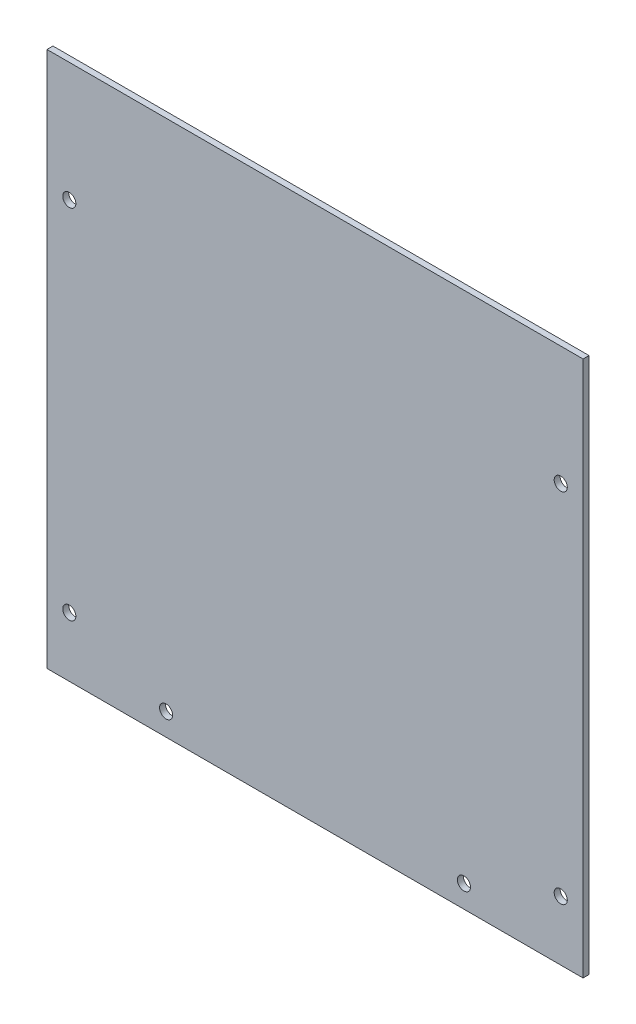
ISO-10303-21;
HEADER;
FILE_DESCRIPTION(('STEP AP214'),'2;1');
FILE_NAME('part.step','',(''),(''),'','','');
FILE_SCHEMA(('AUTOMOTIVE_DESIGN { 1 0 10303 214 1 1 1 1 }'));
ENDSEC;
DATA;
#1=APPLICATION_CONTEXT('core data for automotive mechanical design processes');
#2=APPLICATION_PROTOCOL_DEFINITION('international standard','automotive_design',2000,#1);
#3=PRODUCT_CONTEXT('',#1,'mechanical');
#4=PRODUCT('Part','Part','',(#3));
#5=PRODUCT_RELATED_PRODUCT_CATEGORY('part','',(#4));
#6=PRODUCT_DEFINITION_FORMATION('','',#4);
#7=PRODUCT_DEFINITION_CONTEXT('part definition',#1,'design');
#8=PRODUCT_DEFINITION('design','',#6,#7);
#9=PRODUCT_DEFINITION_SHAPE('','',#8);
#10=(LENGTH_UNIT() NAMED_UNIT(*) SI_UNIT(.MILLI.,.METRE.));
#11=(NAMED_UNIT(*) PLANE_ANGLE_UNIT() SI_UNIT($,.RADIAN.));
#12=(NAMED_UNIT(*) SI_UNIT($,.STERADIAN.) SOLID_ANGLE_UNIT());
#13=UNCERTAINTY_MEASURE_WITH_UNIT(LENGTH_MEASURE(1.E-05),#10,'distance_accuracy_value','');
#14=(GEOMETRIC_REPRESENTATION_CONTEXT(3) GLOBAL_UNCERTAINTY_ASSIGNED_CONTEXT((#13)) GLOBAL_UNIT_ASSIGNED_CONTEXT((#10,
#11,#12)) REPRESENTATION_CONTEXT('',''));
#15=CARTESIAN_POINT('',(0.,0.,0.));
#16=DIRECTION('',(0.,0.,1.));
#17=DIRECTION('',(1.,0.,0.));
#18=AXIS2_PLACEMENT_3D('',#15,#16,#17);
#19=CARTESIAN_POINT('',(90.,90.,2.));
#20=DIRECTION('',(-1.,0.,0.));
#21=DIRECTION('',(0.,-1.,0.));
#22=AXIS2_PLACEMENT_3D('',#19,#20,#21);
#23=PLANE('',#22);
#24=DIRECTION('',(0.,1.,0.));
#25=VECTOR('',#24,1.);
#26=CARTESIAN_POINT('',(90.,90.,0.));
#27=LINE('',#26,#25);
#28=CARTESIAN_POINT('',(90.,-90.,0.));
#29=VERTEX_POINT('',#28);
#30=CARTESIAN_POINT('',(90.,90.,0.));
#31=VERTEX_POINT('',#30);
#32=EDGE_CURVE('E99',#29,#31,#27,.T.);
#33=ORIENTED_EDGE('',*,*,#32,.T.);
#34=DIRECTION('',(0.,0.,-1.));
#35=VECTOR('',#34,1.);
#36=CARTESIAN_POINT('',(90.,90.,2.));
#37=LINE('',#36,#35);
#38=CARTESIAN_POINT('',(90.,90.,2.));
#39=VERTEX_POINT('',#38);
#40=EDGE_CURVE('E11',#39,#31,#37,.T.);
#41=ORIENTED_EDGE('',*,*,#40,.F.);
#42=DIRECTION('',(0.,1.,0.));
#43=VECTOR('',#42,1.);
#44=CARTESIAN_POINT('',(90.,90.,2.));
#45=LINE('',#44,#43);
#46=CARTESIAN_POINT('',(90.,-90.,2.));
#47=VERTEX_POINT('',#46);
#48=EDGE_CURVE('E86',#47,#39,#45,.T.);
#49=ORIENTED_EDGE('',*,*,#48,.F.);
#50=DIRECTION('',(0.,0.,-1.));
#51=VECTOR('',#50,1.);
#52=CARTESIAN_POINT('',(90.,-90.,2.));
#53=LINE('',#52,#51);
#54=EDGE_CURVE('E95',#47,#29,#53,.T.);
#55=ORIENTED_EDGE('',*,*,#54,.T.);
#56=EDGE_LOOP('',(#33,#41,#49,#55));
#57=FACE_BOUND('',#56,.T.);
#58=ADVANCED_FACE('F33',(#57),#23,.F.);
#59=CARTESIAN_POINT('',(-90.,90.,2.));
#60=DIRECTION('',(0.,-1.,0.));
#61=DIRECTION('',(0.,0.,-1.));
#62=AXIS2_PLACEMENT_3D('',#59,#60,#61);
#63=PLANE('',#62);
#64=DIRECTION('',(-1.,0.,0.));
#65=VECTOR('',#64,1.);
#66=CARTESIAN_POINT('',(-90.,90.,0.));
#67=LINE('',#66,#65);
#68=CARTESIAN_POINT('',(-90.,90.,0.));
#69=VERTEX_POINT('',#68);
#70=EDGE_CURVE('E90',#31,#69,#67,.T.);
#71=ORIENTED_EDGE('',*,*,#70,.T.);
#72=DIRECTION('',(0.,0.,-1.));
#73=VECTOR('',#72,1.);
#74=CARTESIAN_POINT('',(-90.,90.,2.));
#75=LINE('',#74,#73);
#76=CARTESIAN_POINT('',(-90.,90.,2.));
#77=VERTEX_POINT('',#76);
#78=EDGE_CURVE('E42',#77,#69,#75,.T.);
#79=ORIENTED_EDGE('',*,*,#78,.F.);
#80=DIRECTION('',(-1.,0.,0.));
#81=VECTOR('',#80,1.);
#82=CARTESIAN_POINT('',(-90.,90.,2.));
#83=LINE('',#82,#81);
#84=EDGE_CURVE('E81',#39,#77,#83,.T.);
#85=ORIENTED_EDGE('',*,*,#84,.F.);
#86=ORIENTED_EDGE('',*,*,#40,.T.);
#87=EDGE_LOOP('',(#71,#79,#85,#86));
#88=FACE_BOUND('',#87,.T.);
#89=ADVANCED_FACE('F89',(#88),#63,.F.);
#90=CARTESIAN_POINT('',(-90.,90.,2.));
#91=DIRECTION('',(1.,0.,0.));
#92=DIRECTION('',(0.,1.,0.));
#93=AXIS2_PLACEMENT_3D('',#90,#91,#92);
#94=PLANE('',#93);
#95=DIRECTION('',(0.,-1.,0.));
#96=VECTOR('',#95,1.);
#97=CARTESIAN_POINT('',(-90.,90.,0.));
#98=LINE('',#97,#96);
#99=CARTESIAN_POINT('',(-90.,-90.,0.));
#100=VERTEX_POINT('',#99);
#101=EDGE_CURVE('E68',#69,#100,#98,.T.);
#102=ORIENTED_EDGE('',*,*,#101,.T.);
#103=DIRECTION('',(0.,0.,-1.));
#104=VECTOR('',#103,1.);
#105=CARTESIAN_POINT('',(-90.,-90.,2.));
#106=LINE('',#105,#104);
#107=CARTESIAN_POINT('',(-90.,-90.,2.));
#108=VERTEX_POINT('',#107);
#109=EDGE_CURVE('E91',#108,#100,#106,.T.);
#110=ORIENTED_EDGE('',*,*,#109,.F.);
#111=DIRECTION('',(0.,-1.,0.));
#112=VECTOR('',#111,1.);
#113=CARTESIAN_POINT('',(-90.,90.,2.));
#114=LINE('',#113,#112);
#115=EDGE_CURVE('E84',#77,#108,#114,.T.);
#116=ORIENTED_EDGE('',*,*,#115,.F.);
#117=ORIENTED_EDGE('',*,*,#78,.T.);
#118=EDGE_LOOP('',(#102,#110,#116,#117));
#119=FACE_BOUND('',#118,.T.);
#120=ADVANCED_FACE('F93',(#119),#94,.F.);
#121=CARTESIAN_POINT('',(-90.,-90.,2.));
#122=DIRECTION('',(0.,1.,0.));
#123=DIRECTION('',(0.,0.,1.));
#124=AXIS2_PLACEMENT_3D('',#121,#122,#123);
#125=PLANE('',#124);
#126=DIRECTION('',(1.,0.,0.));
#127=VECTOR('',#126,1.);
#128=CARTESIAN_POINT('',(-90.,-90.,0.));
#129=LINE('',#128,#127);
#130=EDGE_CURVE('E74',#100,#29,#129,.T.);
#131=ORIENTED_EDGE('',*,*,#130,.T.);
#132=ORIENTED_EDGE('',*,*,#54,.F.);
#133=DIRECTION('',(1.,0.,0.));
#134=VECTOR('',#133,1.);
#135=CARTESIAN_POINT('',(-90.,-90.,2.));
#136=LINE('',#135,#134);
#137=EDGE_CURVE('E51',#108,#47,#136,.T.);
#138=ORIENTED_EDGE('',*,*,#137,.F.);
#139=ORIENTED_EDGE('',*,*,#109,.T.);
#140=EDGE_LOOP('',(#131,#132,#138,#139));
#141=FACE_BOUND('',#140,.T.);
#142=ADVANCED_FACE('F153',(#141),#125,.F.);
#143=CARTESIAN_POINT('',(0.,0.,2.));
#144=DIRECTION('',(0.,0.,1.));
#145=DIRECTION('',(1.,0.,0.));
#146=AXIS2_PLACEMENT_3D('',#143,#144,#145);
#147=PLANE('',#146);
#148=CARTESIAN_POINT('',(82.5,50.,2.));
#149=DIRECTION('',(0.,0.,1.));
#150=DIRECTION('',(1.,0.,0.));
#151=AXIS2_PLACEMENT_3D('',#148,#149,#150);
#152=CIRCLE('',#151,2.20000000000001);
#153=CARTESIAN_POINT('',(84.7,50.,2.));
#154=VERTEX_POINT('',#153);
#155=EDGE_CURVE('E138',#154,#154,#152,.T.);
#156=ORIENTED_EDGE('',*,*,#155,.F.);
#157=EDGE_LOOP('',(#156));
#158=FACE_BOUND('',#157,.T.);
#159=CARTESIAN_POINT('',(82.5,-70.,2.));
#160=DIRECTION('',(0.,0.,1.));
#161=DIRECTION('',(1.,0.,0.));
#162=AXIS2_PLACEMENT_3D('',#159,#160,#161);
#163=CIRCLE('',#162,2.20000000000001);
#164=CARTESIAN_POINT('',(84.7,-70.,2.));
#165=VERTEX_POINT('',#164);
#166=EDGE_CURVE('E141',#165,#165,#163,.T.);
#167=ORIENTED_EDGE('',*,*,#166,.F.);
#168=EDGE_LOOP('',(#167));
#169=FACE_BOUND('',#168,.T.);
#170=CARTESIAN_POINT('',(-82.5,-70.,2.));
#171=DIRECTION('',(0.,0.,1.));
#172=DIRECTION('',(1.,0.,0.));
#173=AXIS2_PLACEMENT_3D('',#170,#171,#172);
#174=CIRCLE('',#173,2.20000000000001);
#175=CARTESIAN_POINT('',(-80.3,-70.,2.));
#176=VERTEX_POINT('',#175);
#177=EDGE_CURVE('E137',#176,#176,#174,.T.);
#178=ORIENTED_EDGE('',*,*,#177,.F.);
#179=EDGE_LOOP('',(#178));
#180=FACE_BOUND('',#179,.T.);
#181=CARTESIAN_POINT('',(-82.5,50.,2.));
#182=DIRECTION('',(0.,0.,1.));
#183=DIRECTION('',(1.,0.,0.));
#184=AXIS2_PLACEMENT_3D('',#181,#182,#183);
#185=CIRCLE('',#184,2.20000000000001);
#186=CARTESIAN_POINT('',(-80.3,50.,2.));
#187=VERTEX_POINT('',#186);
#188=EDGE_CURVE('E118',#187,#187,#185,.T.);
#189=ORIENTED_EDGE('',*,*,#188,.F.);
#190=EDGE_LOOP('',(#189));
#191=FACE_BOUND('',#190,.T.);
#192=CARTESIAN_POINT('',(-50.,-82.5,2.));
#193=DIRECTION('',(0.,0.,1.));
#194=DIRECTION('',(1.,0.,0.));
#195=AXIS2_PLACEMENT_3D('',#192,#193,#194);
#196=CIRCLE('',#195,2.2);
#197=CARTESIAN_POINT('',(-47.8,-82.5,2.));
#198=VERTEX_POINT('',#197);
#199=EDGE_CURVE('E111',#198,#198,#196,.T.);
#200=ORIENTED_EDGE('',*,*,#199,.F.);
#201=EDGE_LOOP('',(#200));
#202=FACE_BOUND('',#201,.T.);
#203=CARTESIAN_POINT('',(50.,-82.5,2.));
#204=DIRECTION('',(0.,0.,1.));
#205=DIRECTION('',(1.,0.,0.));
#206=AXIS2_PLACEMENT_3D('',#203,#204,#205);
#207=CIRCLE('',#206,2.2);
#208=CARTESIAN_POINT('',(52.2,-82.5,2.));
#209=VERTEX_POINT('',#208);
#210=EDGE_CURVE('E125',#209,#209,#207,.T.);
#211=ORIENTED_EDGE('',*,*,#210,.F.);
#212=EDGE_LOOP('',(#211));
#213=FACE_BOUND('',#212,.T.);
#214=ORIENTED_EDGE('',*,*,#48,.T.);
#215=ORIENTED_EDGE('',*,*,#84,.T.);
#216=ORIENTED_EDGE('',*,*,#115,.T.);
#217=ORIENTED_EDGE('',*,*,#137,.T.);
#218=EDGE_LOOP('',(#214,#215,#216,#217));
#219=FACE_BOUND('',#218,.T.);
#220=ADVANCED_FACE('F82',(#158,#169,#180,#191,#202,#213,#219),#147,.T.);
#221=CARTESIAN_POINT('',(0.,0.,0.));
#222=DIRECTION('',(0.,0.,1.));
#223=DIRECTION('',(1.,0.,0.));
#224=AXIS2_PLACEMENT_3D('',#221,#222,#223);
#225=PLANE('',#224);
#226=CARTESIAN_POINT('',(82.5,50.,0.));
#227=DIRECTION('',(0.,0.,1.));
#228=DIRECTION('',(1.,0.,0.));
#229=AXIS2_PLACEMENT_3D('',#226,#227,#228);
#230=CIRCLE('',#229,2.20000000000001);
#231=CARTESIAN_POINT('',(84.7,50.,0.));
#232=VERTEX_POINT('',#231);
#233=EDGE_CURVE('E36',#232,#232,#230,.T.);
#234=ORIENTED_EDGE('',*,*,#233,.T.);
#235=EDGE_LOOP('',(#234));
#236=FACE_BOUND('',#235,.T.);
#237=CARTESIAN_POINT('',(82.5,-70.,0.));
#238=DIRECTION('',(0.,0.,1.));
#239=DIRECTION('',(1.,0.,0.));
#240=AXIS2_PLACEMENT_3D('',#237,#238,#239);
#241=CIRCLE('',#240,2.20000000000001);
#242=CARTESIAN_POINT('',(84.7,-70.,0.));
#243=VERTEX_POINT('',#242);
#244=EDGE_CURVE('E120',#243,#243,#241,.T.);
#245=ORIENTED_EDGE('',*,*,#244,.T.);
#246=EDGE_LOOP('',(#245));
#247=FACE_BOUND('',#246,.T.);
#248=CARTESIAN_POINT('',(-82.5,-70.,0.));
#249=DIRECTION('',(0.,0.,1.));
#250=DIRECTION('',(1.,0.,0.));
#251=AXIS2_PLACEMENT_3D('',#248,#249,#250);
#252=CIRCLE('',#251,2.20000000000001);
#253=CARTESIAN_POINT('',(-80.3,-70.,0.));
#254=VERTEX_POINT('',#253);
#255=EDGE_CURVE('E117',#254,#254,#252,.T.);
#256=ORIENTED_EDGE('',*,*,#255,.T.);
#257=EDGE_LOOP('',(#256));
#258=FACE_BOUND('',#257,.T.);
#259=CARTESIAN_POINT('',(-82.5,50.,0.));
#260=DIRECTION('',(0.,0.,1.));
#261=DIRECTION('',(1.,0.,0.));
#262=AXIS2_PLACEMENT_3D('',#259,#260,#261);
#263=CIRCLE('',#262,2.20000000000001);
#264=CARTESIAN_POINT('',(-80.3,50.,0.));
#265=VERTEX_POINT('',#264);
#266=EDGE_CURVE('E114',#265,#265,#263,.T.);
#267=ORIENTED_EDGE('',*,*,#266,.T.);
#268=EDGE_LOOP('',(#267));
#269=FACE_BOUND('',#268,.T.);
#270=CARTESIAN_POINT('',(-50.,-82.5,0.));
#271=DIRECTION('',(0.,0.,1.));
#272=DIRECTION('',(1.,0.,0.));
#273=AXIS2_PLACEMENT_3D('',#270,#271,#272);
#274=CIRCLE('',#273,2.2);
#275=CARTESIAN_POINT('',(-47.8,-82.5,0.));
#276=VERTEX_POINT('',#275);
#277=EDGE_CURVE('E102',#276,#276,#274,.T.);
#278=ORIENTED_EDGE('',*,*,#277,.T.);
#279=EDGE_LOOP('',(#278));
#280=FACE_BOUND('',#279,.T.);
#281=CARTESIAN_POINT('',(50.,-82.5,0.));
#282=DIRECTION('',(0.,0.,1.));
#283=DIRECTION('',(1.,0.,0.));
#284=AXIS2_PLACEMENT_3D('',#281,#282,#283);
#285=CIRCLE('',#284,2.2);
#286=CARTESIAN_POINT('',(52.2,-82.5,0.));
#287=VERTEX_POINT('',#286);
#288=EDGE_CURVE('E108',#287,#287,#285,.T.);
#289=ORIENTED_EDGE('',*,*,#288,.T.);
#290=EDGE_LOOP('',(#289));
#291=FACE_BOUND('',#290,.T.);
#292=ORIENTED_EDGE('',*,*,#32,.F.);
#293=ORIENTED_EDGE('',*,*,#130,.F.);
#294=ORIENTED_EDGE('',*,*,#101,.F.);
#295=ORIENTED_EDGE('',*,*,#70,.F.);
#296=EDGE_LOOP('',(#292,#293,#294,#295));
#297=FACE_BOUND('',#296,.T.);
#298=ADVANCED_FACE('F152',(#236,#247,#258,#269,#280,#291,#297),#225,.F.);
#299=CARTESIAN_POINT('',(50.,-82.5,-138.));
#300=DIRECTION('',(0.,0.,1.));
#301=DIRECTION('',(1.,0.,0.));
#302=AXIS2_PLACEMENT_3D('',#299,#300,#301);
#303=CYLINDRICAL_SURFACE('',#302,2.2);
#304=ORIENTED_EDGE('',*,*,#210,.T.);
#305=EDGE_LOOP('',(#304));
#306=FACE_BOUND('',#305,.T.);
#307=ORIENTED_EDGE('',*,*,#288,.F.);
#308=EDGE_LOOP('',(#307));
#309=FACE_BOUND('',#308,.T.);
#310=ADVANCED_FACE('F165',(#306,#309),#303,.F.);
#311=CARTESIAN_POINT('',(-50.,-82.5,-138.));
#312=DIRECTION('',(0.,0.,1.));
#313=DIRECTION('',(1.,0.,0.));
#314=AXIS2_PLACEMENT_3D('',#311,#312,#313);
#315=CYLINDRICAL_SURFACE('',#314,2.2);
#316=ORIENTED_EDGE('',*,*,#199,.T.);
#317=EDGE_LOOP('',(#316));
#318=FACE_BOUND('',#317,.T.);
#319=ORIENTED_EDGE('',*,*,#277,.F.);
#320=EDGE_LOOP('',(#319));
#321=FACE_BOUND('',#320,.T.);
#322=ADVANCED_FACE('F161',(#318,#321),#315,.F.);
#323=CARTESIAN_POINT('',(-82.5,50.,-158.));
#324=DIRECTION('',(0.,0.,1.));
#325=DIRECTION('',(1.,0.,0.));
#326=AXIS2_PLACEMENT_3D('',#323,#324,#325);
#327=CYLINDRICAL_SURFACE('',#326,2.20000000000001);
#328=ORIENTED_EDGE('',*,*,#188,.T.);
#329=EDGE_LOOP('',(#328));
#330=FACE_BOUND('',#329,.T.);
#331=ORIENTED_EDGE('',*,*,#266,.F.);
#332=EDGE_LOOP('',(#331));
#333=FACE_BOUND('',#332,.T.);
#334=ADVANCED_FACE('F164',(#330,#333),#327,.F.);
#335=CARTESIAN_POINT('',(-82.5,-70.,-158.));
#336=DIRECTION('',(0.,0.,1.));
#337=DIRECTION('',(1.,0.,0.));
#338=AXIS2_PLACEMENT_3D('',#335,#336,#337);
#339=CYLINDRICAL_SURFACE('',#338,2.20000000000001);
#340=ORIENTED_EDGE('',*,*,#177,.T.);
#341=EDGE_LOOP('',(#340));
#342=FACE_BOUND('',#341,.T.);
#343=ORIENTED_EDGE('',*,*,#255,.F.);
#344=EDGE_LOOP('',(#343));
#345=FACE_BOUND('',#344,.T.);
#346=ADVANCED_FACE('F147',(#342,#345),#339,.F.);
#347=CARTESIAN_POINT('',(82.5,-70.,-158.));
#348=DIRECTION('',(0.,0.,1.));
#349=DIRECTION('',(1.,0.,0.));
#350=AXIS2_PLACEMENT_3D('',#347,#348,#349);
#351=CYLINDRICAL_SURFACE('',#350,2.20000000000001);
#352=ORIENTED_EDGE('',*,*,#166,.T.);
#353=EDGE_LOOP('',(#352));
#354=FACE_BOUND('',#353,.T.);
#355=ORIENTED_EDGE('',*,*,#244,.F.);
#356=EDGE_LOOP('',(#355));
#357=FACE_BOUND('',#356,.T.);
#358=ADVANCED_FACE('F236',(#354,#357),#351,.F.);
#359=CARTESIAN_POINT('',(82.5,50.,-158.));
#360=DIRECTION('',(0.,0.,1.));
#361=DIRECTION('',(1.,0.,0.));
#362=AXIS2_PLACEMENT_3D('',#359,#360,#361);
#363=CYLINDRICAL_SURFACE('',#362,2.20000000000001);
#364=ORIENTED_EDGE('',*,*,#155,.T.);
#365=EDGE_LOOP('',(#364));
#366=FACE_BOUND('',#365,.T.);
#367=ORIENTED_EDGE('',*,*,#233,.F.);
#368=EDGE_LOOP('',(#367));
#369=FACE_BOUND('',#368,.T.);
#370=ADVANCED_FACE('F245',(#366,#369),#363,.F.);
#371=CLOSED_SHELL('',(#58,#89,#120,#142,#220,#298,#310,#322,#334,#346,#358,#370));
#372=MANIFOLD_SOLID_BREP('B2',#371);
#373=ADVANCED_BREP_SHAPE_REPRESENTATION('',(#18,#372),#14);
#374=SHAPE_DEFINITION_REPRESENTATION(#9,#373);
ENDSEC;
END-ISO-10303-21;
